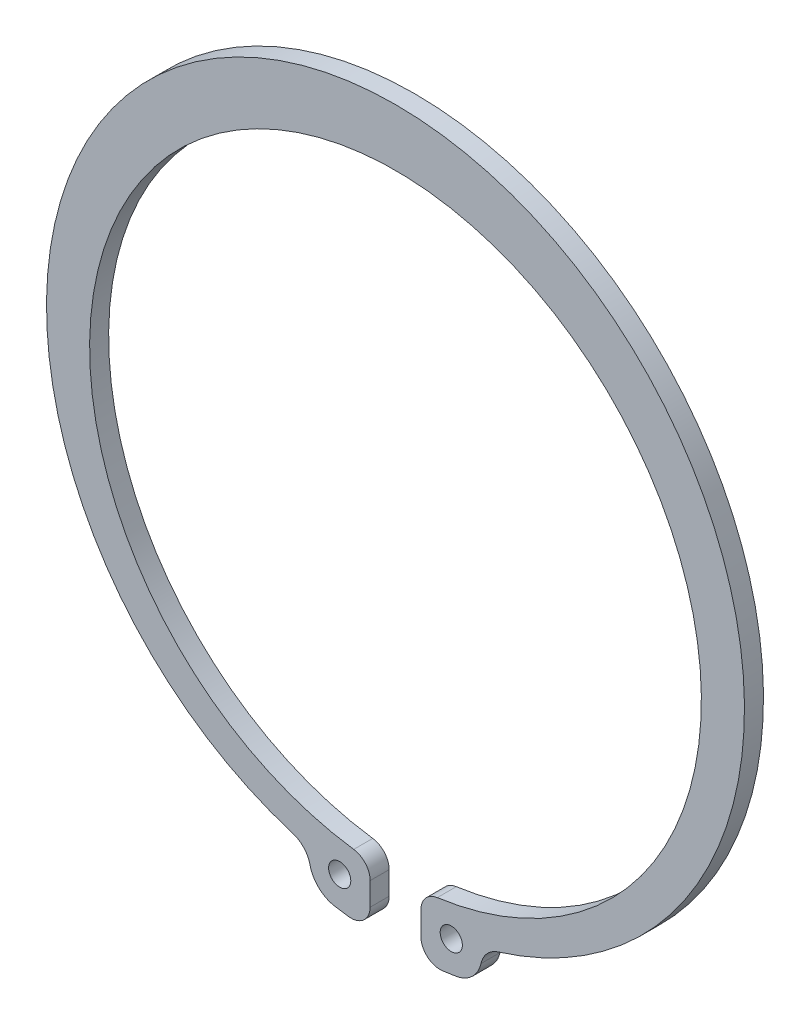
ISO-10303-21;
HEADER;
FILE_DESCRIPTION(('STEP AP214'),'2;1');
FILE_NAME('part.step','',(''),(''),'','','');
FILE_SCHEMA(('AUTOMOTIVE_DESIGN { 1 0 10303 214 1 1 1 1 }'));
ENDSEC;
DATA;
#1=APPLICATION_CONTEXT('core data for automotive mechanical design processes');
#2=APPLICATION_PROTOCOL_DEFINITION('international standard','automotive_design',2000,#1);
#3=PRODUCT_CONTEXT('',#1,'mechanical');
#4=PRODUCT('Part','Part','',(#3));
#5=PRODUCT_RELATED_PRODUCT_CATEGORY('part','',(#4));
#6=PRODUCT_DEFINITION_FORMATION('','',#4);
#7=PRODUCT_DEFINITION_CONTEXT('part definition',#1,'design');
#8=PRODUCT_DEFINITION('design','',#6,#7);
#9=PRODUCT_DEFINITION_SHAPE('','',#8);
#10=(LENGTH_UNIT() NAMED_UNIT(*) SI_UNIT(.MILLI.,.METRE.));
#11=(NAMED_UNIT(*) PLANE_ANGLE_UNIT() SI_UNIT($,.RADIAN.));
#12=(NAMED_UNIT(*) SI_UNIT($,.STERADIAN.) SOLID_ANGLE_UNIT());
#13=UNCERTAINTY_MEASURE_WITH_UNIT(LENGTH_MEASURE(1.E-05),#10,'distance_accuracy_value','');
#14=(GEOMETRIC_REPRESENTATION_CONTEXT(3) GLOBAL_UNCERTAINTY_ASSIGNED_CONTEXT((#13)) GLOBAL_UNIT_ASSIGNED_CONTEXT((#10,
#11,#12)) REPRESENTATION_CONTEXT('',''));
#15=CARTESIAN_POINT('',(0.,0.,0.));
#16=DIRECTION('',(0.,0.,1.));
#17=DIRECTION('',(1.,0.,0.));
#18=AXIS2_PLACEMENT_3D('',#15,#16,#17);
#19=CARTESIAN_POINT('',(7.00000000000002,-50.7697006097141,3.));
#20=DIRECTION('',(0.,0.,-1.));
#21=DIRECTION('',(-1.,0.,0.));
#22=AXIS2_PLACEMENT_3D('',#19,#20,#21);
#23=PLANE('',#22);
#24=CARTESIAN_POINT('',(7.00000000000002,-50.7697006097141,3.));
#25=DIRECTION('',(0.,0.,1.));
#26=DIRECTION('',(-1.,0.,0.));
#27=AXIS2_PLACEMENT_3D('',#24,#25,#26);
#28=CIRCLE('',#27,2.99999999999999);
#29=CARTESIAN_POINT('',(6.59024390243901,-47.7978156959747,3.));
#30=VERTEX_POINT('',#29);
#31=CARTESIAN_POINT('',(4.00000000000002,-50.7697006097141,3.));
#32=VERTEX_POINT('',#31);
#33=EDGE_CURVE('E198',#30,#32,#28,.T.);
#34=ORIENTED_EDGE('',*,*,#33,.T.);
#35=DIRECTION('',(0.,-1.,0.));
#36=VECTOR('',#35,1.);
#37=CARTESIAN_POINT('',(4.00000000000002,-50.7697006097141,3.));
#38=LINE('',#37,#36);
#39=CARTESIAN_POINT('',(4.00000000000002,-54.4014935456739,3.));
#40=VERTEX_POINT('',#39);
#41=EDGE_CURVE('E116',#32,#40,#38,.T.);
#42=ORIENTED_EDGE('',*,*,#41,.T.);
#43=CARTESIAN_POINT('',(7.00000000000002,-54.4014935456739,3.));
#44=DIRECTION('',(0.,0.,1.));
#45=DIRECTION('',(-1.,0.,0.));
#46=AXIS2_PLACEMENT_3D('',#43,#44,#45);
#47=CIRCLE('',#46,3.00000000000001);
#48=CARTESIAN_POINT('',(7.38286235186875,-57.3769626548265,3.));
#49=VERTEX_POINT('',#48);
#50=EDGE_CURVE('E231',#40,#49,#47,.T.);
#51=ORIENTED_EDGE('',*,*,#50,.T.);
#52=CARTESIAN_POINT('',(0.,0.,3.));
#53=DIRECTION('',(0.,0.,1.));
#54=DIRECTION('',(-1.,0.,0.));
#55=AXIS2_PLACEMENT_3D('',#52,#53,#54);
#56=CIRCLE('',#55,57.85);
#57=CARTESIAN_POINT('',(9.59622997172479,-57.0485308341045,3.));
#58=VERTEX_POINT('',#57);
#59=EDGE_CURVE('E250',#49,#58,#56,.T.);
#60=ORIENTED_EDGE('',*,*,#59,.T.);
#61=CARTESIAN_POINT('',(8.80000000000002,-52.3150313007648,3.));
#62=DIRECTION('',(0.,0.,1.));
#63=DIRECTION('',(-1.,0.,0.));
#64=AXIS2_PLACEMENT_3D('',#61,#62,#63);
#65=CIRCLE('',#64,4.79999999999999);
#66=CARTESIAN_POINT('',(13.4847677059102,-53.3604745281382,3.));
#67=VERTEX_POINT('',#66);
#68=EDGE_CURVE('E247',#58,#67,#65,.T.);
#69=ORIENTED_EDGE('',*,*,#68,.T.);
#70=CARTESIAN_POINT('',(17.3887407941687,-54.2316772176161,3.));
#71=DIRECTION('',(0.,0.,-1.));
#72=DIRECTION('',(-1.,0.,0.));
#73=AXIS2_PLACEMENT_3D('',#70,#71,#72);
#74=CIRCLE('',#73,4.00000000000001);
#75=CARTESIAN_POINT('',(16.2108413330904,-50.4090403188784,3.));
#76=VERTEX_POINT('',#75);
#77=EDGE_CURVE('E249',#67,#76,#74,.T.);
#78=ORIENTED_EDGE('',*,*,#77,.T.);
#79=CARTESIAN_POINT('',(0.,2.2,3.));
#80=DIRECTION('',(0.,0.,1.));
#81=DIRECTION('',(1.,0.,0.));
#82=AXIS2_PLACEMENT_3D('',#79,#80,#81);
#83=CIRCLE('',#82,55.05);
#84=CARTESIAN_POINT('',(-16.2108413330904,-50.4090403188783,3.));
#85=VERTEX_POINT('',#84);
#86=EDGE_CURVE('E252',#76,#85,#83,.T.);
#87=ORIENTED_EDGE('',*,*,#86,.T.);
#88=CARTESIAN_POINT('',(-17.3887407941687,-54.2316772176161,3.));
#89=DIRECTION('',(0.,0.,-1.));
#90=DIRECTION('',(1.,0.,0.));
#91=AXIS2_PLACEMENT_3D('',#88,#89,#90);
#92=CIRCLE('',#91,4.);
#93=CARTESIAN_POINT('',(-13.4847677059102,-53.3604745281383,3.));
#94=VERTEX_POINT('',#93);
#95=EDGE_CURVE('E258',#85,#94,#92,.T.);
#96=ORIENTED_EDGE('',*,*,#95,.T.);
#97=CARTESIAN_POINT('',(-8.8,-52.3150313007648,3.));
#98=DIRECTION('',(0.,0.,1.));
#99=DIRECTION('',(1.,0.,0.));
#100=AXIS2_PLACEMENT_3D('',#97,#98,#99);
#101=CIRCLE('',#100,4.8);
#102=CARTESIAN_POINT('',(-9.59622997172479,-57.0485308341045,3.));
#103=VERTEX_POINT('',#102);
#104=EDGE_CURVE('E260',#94,#103,#101,.T.);
#105=ORIENTED_EDGE('',*,*,#104,.T.);
#106=CARTESIAN_POINT('',(0.,0.,3.));
#107=DIRECTION('',(0.,0.,1.));
#108=DIRECTION('',(1.,0.,0.));
#109=AXIS2_PLACEMENT_3D('',#106,#107,#108);
#110=CIRCLE('',#109,57.85);
#111=CARTESIAN_POINT('',(-7.38286235186874,-57.3769626548265,3.));
#112=VERTEX_POINT('',#111);
#113=EDGE_CURVE('E262',#103,#112,#110,.T.);
#114=ORIENTED_EDGE('',*,*,#113,.T.);
#115=CARTESIAN_POINT('',(-7.,-54.4014935456739,3.));
#116=DIRECTION('',(0.,0.,1.));
#117=DIRECTION('',(1.,0.,0.));
#118=AXIS2_PLACEMENT_3D('',#115,#116,#117);
#119=CIRCLE('',#118,3.00000000000001);
#120=CARTESIAN_POINT('',(-4.,-54.4014935456739,3.));
#121=VERTEX_POINT('',#120);
#122=EDGE_CURVE('E153',#112,#121,#119,.T.);
#123=ORIENTED_EDGE('',*,*,#122,.T.);
#124=DIRECTION('',(0.,1.,0.));
#125=VECTOR('',#124,1.);
#126=CARTESIAN_POINT('',(-4.,-50.7697006097141,3.));
#127=LINE('',#126,#125);
#128=CARTESIAN_POINT('',(-4.,-50.7697006097141,3.));
#129=VERTEX_POINT('',#128);
#130=EDGE_CURVE('E147',#121,#129,#127,.T.);
#131=ORIENTED_EDGE('',*,*,#130,.T.);
#132=CARTESIAN_POINT('',(-7.,-50.7697006097141,3.));
#133=DIRECTION('',(0.,0.,1.));
#134=DIRECTION('',(1.,0.,0.));
#135=AXIS2_PLACEMENT_3D('',#132,#133,#134);
#136=CIRCLE('',#135,2.99999999999999);
#137=CARTESIAN_POINT('',(-6.59024390243903,-47.7978156959747,3.));
#138=VERTEX_POINT('',#137);
#139=EDGE_CURVE('E151',#129,#138,#136,.T.);
#140=ORIENTED_EDGE('',*,*,#139,.T.);
#141=CARTESIAN_POINT('',(0.,0.,3.));
#142=DIRECTION('',(0.,0.,-1.));
#143=DIRECTION('',(1.,0.,0.));
#144=AXIS2_PLACEMENT_3D('',#141,#142,#143);
#145=CIRCLE('',#144,48.25);
#146=EDGE_CURVE('E55',#138,#30,#145,.T.);
#147=ORIENTED_EDGE('',*,*,#146,.T.);
#148=EDGE_LOOP('',(#34,#42,#51,#60,#69,#78,#87,#96,#105,#114,#123,#131,#140,#147));
#149=FACE_BOUND('',#148,.T.);
#150=CARTESIAN_POINT('',(8.80000000000002,-52.3150313007648,3.));
#151=DIRECTION('',(0.,0.,1.));
#152=DIRECTION('',(-1.,0.,0.));
#153=AXIS2_PLACEMENT_3D('',#150,#151,#152);
#154=CIRCLE('',#153,1.75);
#155=CARTESIAN_POINT('',(7.05000000000002,-52.3150313007648,3.));
#156=VERTEX_POINT('',#155);
#157=EDGE_CURVE('E175',#156,#156,#154,.T.);
#158=ORIENTED_EDGE('',*,*,#157,.F.);
#159=EDGE_LOOP('',(#158));
#160=FACE_BOUND('',#159,.T.);
#161=CARTESIAN_POINT('',(-8.8,-52.3150313007648,3.));
#162=DIRECTION('',(0.,0.,1.));
#163=DIRECTION('',(1.,0.,0.));
#164=AXIS2_PLACEMENT_3D('',#161,#162,#163);
#165=CIRCLE('',#164,1.75);
#166=CARTESIAN_POINT('',(-7.05,-52.3150313007648,3.));
#167=VERTEX_POINT('',#166);
#168=EDGE_CURVE('E303',#167,#167,#165,.T.);
#169=ORIENTED_EDGE('',*,*,#168,.F.);
#170=EDGE_LOOP('',(#169));
#171=FACE_BOUND('',#170,.T.);
#172=ADVANCED_FACE('F38',(#149,#160,#171),#23,.F.);
#173=CARTESIAN_POINT('',(7.00000000000002,-50.7697006097141,0.));
#174=DIRECTION('',(0.,0.,-1.));
#175=DIRECTION('',(-1.,0.,0.));
#176=AXIS2_PLACEMENT_3D('',#173,#174,#175);
#177=PLANE('',#176);
#178=CARTESIAN_POINT('',(8.80000000000002,-52.3150313007648,0.));
#179=DIRECTION('',(0.,0.,1.));
#180=DIRECTION('',(-1.,0.,0.));
#181=AXIS2_PLACEMENT_3D('',#178,#179,#180);
#182=CIRCLE('',#181,1.75);
#183=CARTESIAN_POINT('',(7.05000000000002,-52.3150313007648,0.));
#184=VERTEX_POINT('',#183);
#185=EDGE_CURVE('E308',#184,#184,#182,.T.);
#186=ORIENTED_EDGE('',*,*,#185,.T.);
#187=EDGE_LOOP('',(#186));
#188=FACE_BOUND('',#187,.T.);
#189=CARTESIAN_POINT('',(7.00000000000002,-50.7697006097141,0.));
#190=DIRECTION('',(0.,0.,1.));
#191=DIRECTION('',(-1.,0.,0.));
#192=AXIS2_PLACEMENT_3D('',#189,#190,#191);
#193=CIRCLE('',#192,2.99999999999999);
#194=CARTESIAN_POINT('',(6.59024390243901,-47.7978156959747,0.));
#195=VERTEX_POINT('',#194);
#196=CARTESIAN_POINT('',(4.00000000000002,-50.7697006097141,0.));
#197=VERTEX_POINT('',#196);
#198=EDGE_CURVE('E171',#195,#197,#193,.T.);
#199=ORIENTED_EDGE('',*,*,#198,.F.);
#200=CARTESIAN_POINT('',(0.,0.,0.));
#201=DIRECTION('',(0.,0.,-1.));
#202=DIRECTION('',(1.,0.,0.));
#203=AXIS2_PLACEMENT_3D('',#200,#201,#202);
#204=CIRCLE('',#203,48.25);
#205=CARTESIAN_POINT('',(-6.59024390243903,-47.7978156959747,0.));
#206=VERTEX_POINT('',#205);
#207=EDGE_CURVE('E108',#206,#195,#204,.T.);
#208=ORIENTED_EDGE('',*,*,#207,.F.);
#209=CARTESIAN_POINT('',(-7.,-50.7697006097141,0.));
#210=DIRECTION('',(0.,0.,1.));
#211=DIRECTION('',(1.,0.,0.));
#212=AXIS2_PLACEMENT_3D('',#209,#210,#211);
#213=CIRCLE('',#212,2.99999999999999);
#214=CARTESIAN_POINT('',(-4.,-50.7697006097141,0.));
#215=VERTEX_POINT('',#214);
#216=EDGE_CURVE('E102',#215,#206,#213,.T.);
#217=ORIENTED_EDGE('',*,*,#216,.F.);
#218=DIRECTION('',(0.,1.,0.));
#219=VECTOR('',#218,1.);
#220=CARTESIAN_POINT('',(-4.,-50.7697006097141,0.));
#221=LINE('',#220,#219);
#222=CARTESIAN_POINT('',(-4.,-54.4014935456739,0.));
#223=VERTEX_POINT('',#222);
#224=EDGE_CURVE('E161',#223,#215,#221,.T.);
#225=ORIENTED_EDGE('',*,*,#224,.F.);
#226=CARTESIAN_POINT('',(-7.,-54.4014935456739,0.));
#227=DIRECTION('',(0.,0.,1.));
#228=DIRECTION('',(1.,0.,0.));
#229=AXIS2_PLACEMENT_3D('',#226,#227,#228);
#230=CIRCLE('',#229,3.00000000000001);
#231=CARTESIAN_POINT('',(-7.38286235186874,-57.3769626548265,0.));
#232=VERTEX_POINT('',#231);
#233=EDGE_CURVE('E193',#232,#223,#230,.T.);
#234=ORIENTED_EDGE('',*,*,#233,.F.);
#235=CARTESIAN_POINT('',(0.,0.,0.));
#236=DIRECTION('',(0.,0.,1.));
#237=DIRECTION('',(1.,0.,0.));
#238=AXIS2_PLACEMENT_3D('',#235,#236,#237);
#239=CIRCLE('',#238,57.85);
#240=CARTESIAN_POINT('',(-9.59622997172479,-57.0485308341045,0.));
#241=VERTEX_POINT('',#240);
#242=EDGE_CURVE('E191',#241,#232,#239,.T.);
#243=ORIENTED_EDGE('',*,*,#242,.F.);
#244=CARTESIAN_POINT('',(-8.8,-52.3150313007648,0.));
#245=DIRECTION('',(0.,0.,1.));
#246=DIRECTION('',(1.,0.,0.));
#247=AXIS2_PLACEMENT_3D('',#244,#245,#246);
#248=CIRCLE('',#247,4.8);
#249=CARTESIAN_POINT('',(-13.4847677059102,-53.3604745281383,0.));
#250=VERTEX_POINT('',#249);
#251=EDGE_CURVE('E189',#250,#241,#248,.T.);
#252=ORIENTED_EDGE('',*,*,#251,.F.);
#253=CARTESIAN_POINT('',(-17.3887407941687,-54.2316772176161,0.));
#254=DIRECTION('',(0.,0.,-1.));
#255=DIRECTION('',(1.,0.,0.));
#256=AXIS2_PLACEMENT_3D('',#253,#254,#255);
#257=CIRCLE('',#256,4.);
#258=CARTESIAN_POINT('',(-16.2108413330904,-50.4090403188783,0.));
#259=VERTEX_POINT('',#258);
#260=EDGE_CURVE('E187',#259,#250,#257,.T.);
#261=ORIENTED_EDGE('',*,*,#260,.F.);
#262=CARTESIAN_POINT('',(0.,2.2,0.));
#263=DIRECTION('',(0.,0.,1.));
#264=DIRECTION('',(1.,0.,0.));
#265=AXIS2_PLACEMENT_3D('',#262,#263,#264);
#266=CIRCLE('',#265,55.05);
#267=CARTESIAN_POINT('',(16.2108413330904,-50.4090403188784,0.));
#268=VERTEX_POINT('',#267);
#269=EDGE_CURVE('E185',#268,#259,#266,.T.);
#270=ORIENTED_EDGE('',*,*,#269,.F.);
#271=CARTESIAN_POINT('',(17.3887407941687,-54.2316772176161,0.));
#272=DIRECTION('',(0.,0.,-1.));
#273=DIRECTION('',(-1.,0.,0.));
#274=AXIS2_PLACEMENT_3D('',#271,#272,#273);
#275=CIRCLE('',#274,4.00000000000001);
#276=CARTESIAN_POINT('',(13.4847677059102,-53.3604745281382,0.));
#277=VERTEX_POINT('',#276);
#278=EDGE_CURVE('E183',#277,#268,#275,.T.);
#279=ORIENTED_EDGE('',*,*,#278,.F.);
#280=CARTESIAN_POINT('',(8.80000000000002,-52.3150313007648,0.));
#281=DIRECTION('',(0.,0.,1.));
#282=DIRECTION('',(-1.,0.,0.));
#283=AXIS2_PLACEMENT_3D('',#280,#281,#282);
#284=CIRCLE('',#283,4.79999999999999);
#285=CARTESIAN_POINT('',(9.59622997172479,-57.0485308341045,0.));
#286=VERTEX_POINT('',#285);
#287=EDGE_CURVE('E181',#286,#277,#284,.T.);
#288=ORIENTED_EDGE('',*,*,#287,.F.);
#289=CARTESIAN_POINT('',(0.,0.,0.));
#290=DIRECTION('',(0.,0.,1.));
#291=DIRECTION('',(-1.,0.,0.));
#292=AXIS2_PLACEMENT_3D('',#289,#290,#291);
#293=CIRCLE('',#292,57.85);
#294=CARTESIAN_POINT('',(7.38286235186875,-57.3769626548265,0.));
#295=VERTEX_POINT('',#294);
#296=EDGE_CURVE('E179',#295,#286,#293,.T.);
#297=ORIENTED_EDGE('',*,*,#296,.F.);
#298=CARTESIAN_POINT('',(7.00000000000002,-54.4014935456739,0.));
#299=DIRECTION('',(0.,0.,1.));
#300=DIRECTION('',(-1.,0.,0.));
#301=AXIS2_PLACEMENT_3D('',#298,#299,#300);
#302=CIRCLE('',#301,3.00000000000001);
#303=CARTESIAN_POINT('',(4.00000000000002,-54.4014935456739,0.));
#304=VERTEX_POINT('',#303);
#305=EDGE_CURVE('E177',#304,#295,#302,.T.);
#306=ORIENTED_EDGE('',*,*,#305,.F.);
#307=DIRECTION('',(0.,-1.,0.));
#308=VECTOR('',#307,1.);
#309=CARTESIAN_POINT('',(4.00000000000002,-50.7697006097141,0.));
#310=LINE('',#309,#308);
#311=EDGE_CURVE('E174',#197,#304,#310,.T.);
#312=ORIENTED_EDGE('',*,*,#311,.F.);
#313=EDGE_LOOP('',(#199,#208,#217,#225,#234,#243,#252,#261,#270,#279,#288,#297,#306,#312));
#314=FACE_BOUND('',#313,.T.);
#315=CARTESIAN_POINT('',(-8.8,-52.3150313007648,0.));
#316=DIRECTION('',(0.,0.,1.));
#317=DIRECTION('',(1.,0.,0.));
#318=AXIS2_PLACEMENT_3D('',#315,#316,#317);
#319=CIRCLE('',#318,1.75);
#320=CARTESIAN_POINT('',(-7.05,-52.3150313007648,0.));
#321=VERTEX_POINT('',#320);
#322=EDGE_CURVE('E306',#321,#321,#319,.T.);
#323=ORIENTED_EDGE('',*,*,#322,.T.);
#324=EDGE_LOOP('',(#323));
#325=FACE_BOUND('',#324,.T.);
#326=ADVANCED_FACE('F235',(#188,#314,#325),#177,.T.);
#327=CARTESIAN_POINT('',(7.00000000000002,-50.7697006097141,3.));
#328=DIRECTION('',(0.,0.,-1.));
#329=DIRECTION('',(-1.,0.,0.));
#330=AXIS2_PLACEMENT_3D('',#327,#328,#329);
#331=CYLINDRICAL_SURFACE('',#330,2.99999999999999);
#332=ORIENTED_EDGE('',*,*,#198,.T.);
#333=DIRECTION('',(0.,0.,-1.));
#334=VECTOR('',#333,1.);
#335=CARTESIAN_POINT('',(4.00000000000002,-50.7697006097141,3.));
#336=LINE('',#335,#334);
#337=EDGE_CURVE('E11',#32,#197,#336,.T.);
#338=ORIENTED_EDGE('',*,*,#337,.F.);
#339=ORIENTED_EDGE('',*,*,#33,.F.);
#340=DIRECTION('',(0.,0.,-1.));
#341=VECTOR('',#340,1.);
#342=CARTESIAN_POINT('',(6.59024390243901,-47.7978156959747,3.));
#343=LINE('',#342,#341);
#344=EDGE_CURVE('E167',#30,#195,#343,.T.);
#345=ORIENTED_EDGE('',*,*,#344,.T.);
#346=EDGE_LOOP('',(#332,#338,#339,#345));
#347=FACE_BOUND('',#346,.T.);
#348=ADVANCED_FACE('F40',(#347),#331,.T.);
#349=CARTESIAN_POINT('',(4.00000000000002,-50.7697006097141,3.));
#350=DIRECTION('',(1.,0.,0.));
#351=DIRECTION('',(0.,1.,0.));
#352=AXIS2_PLACEMENT_3D('',#349,#350,#351);
#353=PLANE('',#352);
#354=ORIENTED_EDGE('',*,*,#311,.T.);
#355=DIRECTION('',(0.,0.,-1.));
#356=VECTOR('',#355,1.);
#357=CARTESIAN_POINT('',(4.00000000000002,-54.4014935456739,3.));
#358=LINE('',#357,#356);
#359=EDGE_CURVE('E47',#40,#304,#358,.T.);
#360=ORIENTED_EDGE('',*,*,#359,.F.);
#361=ORIENTED_EDGE('',*,*,#41,.F.);
#362=ORIENTED_EDGE('',*,*,#337,.T.);
#363=EDGE_LOOP('',(#354,#360,#361,#362));
#364=FACE_BOUND('',#363,.T.);
#365=ADVANCED_FACE('F425',(#364),#353,.F.);
#366=CARTESIAN_POINT('',(7.00000000000002,-54.4014935456739,3.));
#367=DIRECTION('',(0.,0.,-1.));
#368=DIRECTION('',(-1.,0.,0.));
#369=AXIS2_PLACEMENT_3D('',#366,#367,#368);
#370=CYLINDRICAL_SURFACE('',#369,3.00000000000001);
#371=ORIENTED_EDGE('',*,*,#305,.T.);
#372=DIRECTION('',(0.,0.,-1.));
#373=VECTOR('',#372,1.);
#374=CARTESIAN_POINT('',(7.38286235186875,-57.3769626548265,3.));
#375=LINE('',#374,#373);
#376=EDGE_CURVE('E223',#49,#295,#375,.T.);
#377=ORIENTED_EDGE('',*,*,#376,.F.);
#378=ORIENTED_EDGE('',*,*,#50,.F.);
#379=ORIENTED_EDGE('',*,*,#359,.T.);
#380=EDGE_LOOP('',(#371,#377,#378,#379));
#381=FACE_BOUND('',#380,.T.);
#382=ADVANCED_FACE('F229',(#381),#370,.T.);
#383=CARTESIAN_POINT('',(0.,0.,3.));
#384=DIRECTION('',(0.,0.,-1.));
#385=DIRECTION('',(-1.,0.,0.));
#386=AXIS2_PLACEMENT_3D('',#383,#384,#385);
#387=CYLINDRICAL_SURFACE('',#386,57.85);
#388=ORIENTED_EDGE('',*,*,#296,.T.);
#389=DIRECTION('',(0.,0.,-1.));
#390=VECTOR('',#389,1.);
#391=CARTESIAN_POINT('',(9.59622997172479,-57.0485308341045,3.));
#392=LINE('',#391,#390);
#393=EDGE_CURVE('E220',#58,#286,#392,.T.);
#394=ORIENTED_EDGE('',*,*,#393,.F.);
#395=ORIENTED_EDGE('',*,*,#59,.F.);
#396=ORIENTED_EDGE('',*,*,#376,.T.);
#397=EDGE_LOOP('',(#388,#394,#395,#396));
#398=FACE_BOUND('',#397,.T.);
#399=ADVANCED_FACE('F241',(#398),#387,.T.);
#400=CARTESIAN_POINT('',(8.80000000000002,-52.3150313007648,3.));
#401=DIRECTION('',(0.,0.,-1.));
#402=DIRECTION('',(-1.,0.,0.));
#403=AXIS2_PLACEMENT_3D('',#400,#401,#402);
#404=CYLINDRICAL_SURFACE('',#403,4.79999999999999);
#405=ORIENTED_EDGE('',*,*,#287,.T.);
#406=DIRECTION('',(0.,0.,-1.));
#407=VECTOR('',#406,1.);
#408=CARTESIAN_POINT('',(13.4847677059102,-53.3604745281382,3.));
#409=LINE('',#408,#407);
#410=EDGE_CURVE('E217',#67,#277,#409,.T.);
#411=ORIENTED_EDGE('',*,*,#410,.F.);
#412=ORIENTED_EDGE('',*,*,#68,.F.);
#413=ORIENTED_EDGE('',*,*,#393,.T.);
#414=EDGE_LOOP('',(#405,#411,#412,#413));
#415=FACE_BOUND('',#414,.T.);
#416=ADVANCED_FACE('F245',(#415),#404,.T.);
#417=CARTESIAN_POINT('',(17.3887407941687,-54.2316772176161,3.));
#418=DIRECTION('',(0.,0.,-1.));
#419=DIRECTION('',(-1.,0.,0.));
#420=AXIS2_PLACEMENT_3D('',#417,#418,#419);
#421=CYLINDRICAL_SURFACE('',#420,4.00000000000001);
#422=ORIENTED_EDGE('',*,*,#278,.T.);
#423=DIRECTION('',(0.,0.,-1.));
#424=VECTOR('',#423,1.);
#425=CARTESIAN_POINT('',(16.2108413330904,-50.4090403188784,3.));
#426=LINE('',#425,#424);
#427=EDGE_CURVE('E214',#76,#268,#426,.T.);
#428=ORIENTED_EDGE('',*,*,#427,.F.);
#429=ORIENTED_EDGE('',*,*,#77,.F.);
#430=ORIENTED_EDGE('',*,*,#410,.T.);
#431=EDGE_LOOP('',(#422,#428,#429,#430));
#432=FACE_BOUND('',#431,.T.);
#433=ADVANCED_FACE('F390',(#432),#421,.F.);
#434=CARTESIAN_POINT('',(0.,2.2,3.));
#435=DIRECTION('',(0.,0.,-1.));
#436=DIRECTION('',(-1.,0.,0.));
#437=AXIS2_PLACEMENT_3D('',#434,#435,#436);
#438=CYLINDRICAL_SURFACE('',#437,55.05);
#439=ORIENTED_EDGE('',*,*,#269,.T.);
#440=DIRECTION('',(0.,0.,-1.));
#441=VECTOR('',#440,1.);
#442=CARTESIAN_POINT('',(-16.2108413330904,-50.4090403188783,3.));
#443=LINE('',#442,#441);
#444=EDGE_CURVE('E211',#85,#259,#443,.T.);
#445=ORIENTED_EDGE('',*,*,#444,.F.);
#446=ORIENTED_EDGE('',*,*,#86,.F.);
#447=ORIENTED_EDGE('',*,*,#427,.T.);
#448=EDGE_LOOP('',(#439,#445,#446,#447));
#449=FACE_BOUND('',#448,.T.);
#450=ADVANCED_FACE('F380',(#449),#438,.T.);
#451=CARTESIAN_POINT('',(-17.3887407941687,-54.2316772176161,3.));
#452=DIRECTION('',(0.,0.,-1.));
#453=DIRECTION('',(-1.,0.,0.));
#454=AXIS2_PLACEMENT_3D('',#451,#452,#453);
#455=CYLINDRICAL_SURFACE('',#454,4.);
#456=ORIENTED_EDGE('',*,*,#260,.T.);
#457=DIRECTION('',(0.,0.,-1.));
#458=VECTOR('',#457,1.);
#459=CARTESIAN_POINT('',(-13.4847677059102,-53.3604745281383,3.));
#460=LINE('',#459,#458);
#461=EDGE_CURVE('E208',#94,#250,#460,.T.);
#462=ORIENTED_EDGE('',*,*,#461,.F.);
#463=ORIENTED_EDGE('',*,*,#95,.F.);
#464=ORIENTED_EDGE('',*,*,#444,.T.);
#465=EDGE_LOOP('',(#456,#462,#463,#464));
#466=FACE_BOUND('',#465,.T.);
#467=ADVANCED_FACE('F370',(#466),#455,.F.);
#468=CARTESIAN_POINT('',(-8.8,-52.3150313007648,3.));
#469=DIRECTION('',(0.,0.,-1.));
#470=DIRECTION('',(-1.,0.,0.));
#471=AXIS2_PLACEMENT_3D('',#468,#469,#470);
#472=CYLINDRICAL_SURFACE('',#471,4.8);
#473=ORIENTED_EDGE('',*,*,#251,.T.);
#474=DIRECTION('',(0.,0.,-1.));
#475=VECTOR('',#474,1.);
#476=CARTESIAN_POINT('',(-9.59622997172479,-57.0485308341045,3.));
#477=LINE('',#476,#475);
#478=EDGE_CURVE('E205',#103,#241,#477,.T.);
#479=ORIENTED_EDGE('',*,*,#478,.F.);
#480=ORIENTED_EDGE('',*,*,#104,.F.);
#481=ORIENTED_EDGE('',*,*,#461,.T.);
#482=EDGE_LOOP('',(#473,#479,#480,#481));
#483=FACE_BOUND('',#482,.T.);
#484=ADVANCED_FACE('F361',(#483),#472,.T.);
#485=CARTESIAN_POINT('',(0.,0.,3.));
#486=DIRECTION('',(0.,0.,-1.));
#487=DIRECTION('',(-1.,0.,0.));
#488=AXIS2_PLACEMENT_3D('',#485,#486,#487);
#489=CYLINDRICAL_SURFACE('',#488,57.85);
#490=ORIENTED_EDGE('',*,*,#242,.T.);
#491=DIRECTION('',(0.,0.,-1.));
#492=VECTOR('',#491,1.);
#493=CARTESIAN_POINT('',(-7.38286235186874,-57.3769626548265,3.));
#494=LINE('',#493,#492);
#495=EDGE_CURVE('E202',#112,#232,#494,.T.);
#496=ORIENTED_EDGE('',*,*,#495,.F.);
#497=ORIENTED_EDGE('',*,*,#113,.F.);
#498=ORIENTED_EDGE('',*,*,#478,.T.);
#499=EDGE_LOOP('',(#490,#496,#497,#498));
#500=FACE_BOUND('',#499,.T.);
#501=ADVANCED_FACE('F268',(#500),#489,.T.);
#502=CARTESIAN_POINT('',(-7.,-54.4014935456739,3.));
#503=DIRECTION('',(0.,0.,-1.));
#504=DIRECTION('',(-1.,0.,0.));
#505=AXIS2_PLACEMENT_3D('',#502,#503,#504);
#506=CYLINDRICAL_SURFACE('',#505,3.00000000000001);
#507=ORIENTED_EDGE('',*,*,#233,.T.);
#508=DIRECTION('',(0.,0.,-1.));
#509=VECTOR('',#508,1.);
#510=CARTESIAN_POINT('',(-4.,-54.4014935456739,3.));
#511=LINE('',#510,#509);
#512=EDGE_CURVE('E162',#121,#223,#511,.T.);
#513=ORIENTED_EDGE('',*,*,#512,.F.);
#514=ORIENTED_EDGE('',*,*,#122,.F.);
#515=ORIENTED_EDGE('',*,*,#495,.T.);
#516=EDGE_LOOP('',(#507,#513,#514,#515));
#517=FACE_BOUND('',#516,.T.);
#518=ADVANCED_FACE('F272',(#517),#506,.T.);
#519=CARTESIAN_POINT('',(-4.,-50.7697006097141,3.));
#520=DIRECTION('',(-1.,0.,0.));
#521=DIRECTION('',(0.,-1.,0.));
#522=AXIS2_PLACEMENT_3D('',#519,#520,#521);
#523=PLANE('',#522);
#524=ORIENTED_EDGE('',*,*,#224,.T.);
#525=DIRECTION('',(0.,0.,-1.));
#526=VECTOR('',#525,1.);
#527=CARTESIAN_POINT('',(-4.,-50.7697006097141,3.));
#528=LINE('',#527,#526);
#529=EDGE_CURVE('E158',#129,#215,#528,.T.);
#530=ORIENTED_EDGE('',*,*,#529,.F.);
#531=ORIENTED_EDGE('',*,*,#130,.F.);
#532=ORIENTED_EDGE('',*,*,#512,.T.);
#533=EDGE_LOOP('',(#524,#530,#531,#532));
#534=FACE_BOUND('',#533,.T.);
#535=ADVANCED_FACE('F159',(#534),#523,.F.);
#536=CARTESIAN_POINT('',(-7.,-50.7697006097141,3.));
#537=DIRECTION('',(0.,0.,-1.));
#538=DIRECTION('',(-1.,0.,0.));
#539=AXIS2_PLACEMENT_3D('',#536,#537,#538);
#540=CYLINDRICAL_SURFACE('',#539,2.99999999999999);
#541=ORIENTED_EDGE('',*,*,#216,.T.);
#542=DIRECTION('',(0.,0.,-1.));
#543=VECTOR('',#542,1.);
#544=CARTESIAN_POINT('',(-6.59024390243903,-47.7978156959747,3.));
#545=LINE('',#544,#543);
#546=EDGE_CURVE('E163',#138,#206,#545,.T.);
#547=ORIENTED_EDGE('',*,*,#546,.F.);
#548=ORIENTED_EDGE('',*,*,#139,.F.);
#549=ORIENTED_EDGE('',*,*,#529,.T.);
#550=EDGE_LOOP('',(#541,#547,#548,#549));
#551=FACE_BOUND('',#550,.T.);
#552=ADVANCED_FACE('F165',(#551),#540,.T.);
#553=CARTESIAN_POINT('',(0.,0.,3.));
#554=DIRECTION('',(0.,0.,-1.));
#555=DIRECTION('',(-1.,0.,0.));
#556=AXIS2_PLACEMENT_3D('',#553,#554,#555);
#557=CYLINDRICAL_SURFACE('',#556,48.25);
#558=ORIENTED_EDGE('',*,*,#207,.T.);
#559=ORIENTED_EDGE('',*,*,#344,.F.);
#560=ORIENTED_EDGE('',*,*,#146,.F.);
#561=ORIENTED_EDGE('',*,*,#546,.T.);
#562=EDGE_LOOP('',(#558,#559,#560,#561));
#563=FACE_BOUND('',#562,.T.);
#564=ADVANCED_FACE('F276',(#563),#557,.F.);
#565=CARTESIAN_POINT('',(8.80000000000002,-52.3150313007648,3.));
#566=DIRECTION('',(0.,0.,-1.));
#567=DIRECTION('',(-1.,0.,0.));
#568=AXIS2_PLACEMENT_3D('',#565,#566,#567);
#569=CYLINDRICAL_SURFACE('',#568,1.75);
#570=ORIENTED_EDGE('',*,*,#157,.T.);
#571=EDGE_LOOP('',(#570));
#572=FACE_BOUND('',#571,.T.);
#573=ORIENTED_EDGE('',*,*,#185,.F.);
#574=EDGE_LOOP('',(#573));
#575=FACE_BOUND('',#574,.T.);
#576=ADVANCED_FACE('F278',(#572,#575),#569,.F.);
#577=CARTESIAN_POINT('',(-8.8,-52.3150313007648,3.));
#578=DIRECTION('',(0.,0.,-1.));
#579=DIRECTION('',(-1.,0.,0.));
#580=AXIS2_PLACEMENT_3D('',#577,#578,#579);
#581=CYLINDRICAL_SURFACE('',#580,1.75);
#582=ORIENTED_EDGE('',*,*,#168,.T.);
#583=EDGE_LOOP('',(#582));
#584=FACE_BOUND('',#583,.T.);
#585=ORIENTED_EDGE('',*,*,#322,.F.);
#586=EDGE_LOOP('',(#585));
#587=FACE_BOUND('',#586,.T.);
#588=ADVANCED_FACE('F284',(#584,#587),#581,.F.);
#589=CLOSED_SHELL('',(#172,#326,#348,#365,#382,#399,#416,#433,#450,#467,#484,#501,#518,#535,
#552,#564,#576,#588));
#590=MANIFOLD_SOLID_BREP('B2',#589);
#591=ADVANCED_BREP_SHAPE_REPRESENTATION('',(#18,#590),#14);
#592=SHAPE_DEFINITION_REPRESENTATION(#9,#591);
ENDSEC;
END-ISO-10303-21;
